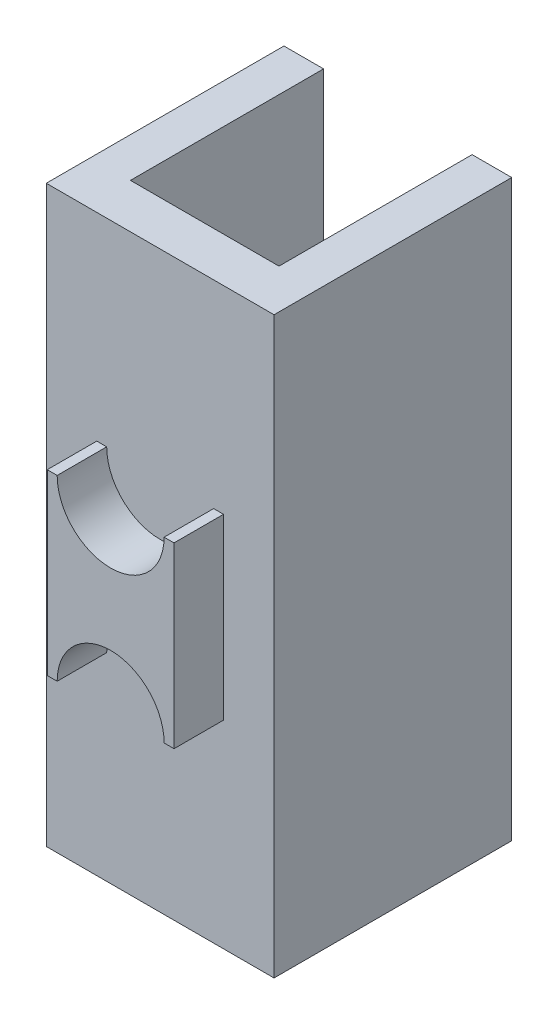
ISO-10303-21;
HEADER;
FILE_DESCRIPTION(('STEP AP214'),'2;1');
FILE_NAME('part.step','',(''),(''),'','','');
FILE_SCHEMA(('AUTOMOTIVE_DESIGN { 1 0 10303 214 1 1 1 1 }'));
ENDSEC;
DATA;
#1=APPLICATION_CONTEXT('core data for automotive mechanical design processes');
#2=APPLICATION_PROTOCOL_DEFINITION('international standard','automotive_design',2000,#1);
#3=PRODUCT_CONTEXT('',#1,'mechanical');
#4=PRODUCT('Part','Part','',(#3));
#5=PRODUCT_RELATED_PRODUCT_CATEGORY('part','',(#4));
#6=PRODUCT_DEFINITION_FORMATION('','',#4);
#7=PRODUCT_DEFINITION_CONTEXT('part definition',#1,'design');
#8=PRODUCT_DEFINITION('design','',#6,#7);
#9=PRODUCT_DEFINITION_SHAPE('','',#8);
#10=(LENGTH_UNIT() NAMED_UNIT(*) SI_UNIT(.MILLI.,.METRE.));
#11=(NAMED_UNIT(*) PLANE_ANGLE_UNIT() SI_UNIT($,.RADIAN.));
#12=(NAMED_UNIT(*) SI_UNIT($,.STERADIAN.) SOLID_ANGLE_UNIT());
#13=UNCERTAINTY_MEASURE_WITH_UNIT(LENGTH_MEASURE(1.E-05),#10,'distance_accuracy_value','');
#14=(GEOMETRIC_REPRESENTATION_CONTEXT(3) GLOBAL_UNCERTAINTY_ASSIGNED_CONTEXT((#13)) GLOBAL_UNIT_ASSIGNED_CONTEXT((#10,
#11,#12)) REPRESENTATION_CONTEXT('',''));
#15=CARTESIAN_POINT('',(0.,0.,0.));
#16=DIRECTION('',(0.,0.,1.));
#17=DIRECTION('',(1.,0.,0.));
#18=AXIS2_PLACEMENT_3D('',#15,#16,#17);
#19=CARTESIAN_POINT('',(-0.64,-0.9,0.5));
#20=DIRECTION('',(0.,0.,1.));
#21=DIRECTION('',(1.,0.,0.));
#22=AXIS2_PLACEMENT_3D('',#19,#20,#21);
#23=PLANE('',#22);
#24=DIRECTION('',(0.,1.,0.));
#25=VECTOR('',#24,1.);
#26=CARTESIAN_POINT('',(0.64,-0.9,0.5));
#27=LINE('',#26,#25);
#28=CARTESIAN_POINT('',(0.64,-0.9,0.5));
#29=VERTEX_POINT('',#28);
#30=CARTESIAN_POINT('',(0.64,0.9,0.5));
#31=VERTEX_POINT('',#30);
#32=EDGE_CURVE('E227',#29,#31,#27,.T.);
#33=ORIENTED_EDGE('',*,*,#32,.T.);
#34=DIRECTION('',(1.,0.,0.));
#35=VECTOR('',#34,1.);
#36=CARTESIAN_POINT('',(0.64,0.9,0.5));
#37=LINE('',#36,#35);
#38=CARTESIAN_POINT('',(0.540000000000001,0.9,0.5));
#39=VERTEX_POINT('',#38);
#40=EDGE_CURVE('E139',#31,#39,#37,.F.);
#41=ORIENTED_EDGE('',*,*,#40,.T.);
#42=CARTESIAN_POINT('',(0.,0.9,0.5));
#43=DIRECTION('',(0.,0.,1.));
#44=DIRECTION('',(1.,0.,0.));
#45=AXIS2_PLACEMENT_3D('',#42,#43,#44);
#46=CIRCLE('',#45,0.54);
#47=CARTESIAN_POINT('',(-0.539999999999999,0.9,0.5));
#48=VERTEX_POINT('',#47);
#49=EDGE_CURVE('E20',#39,#48,#46,.F.);
#50=ORIENTED_EDGE('',*,*,#49,.T.);
#51=DIRECTION('',(1.,0.,0.));
#52=VECTOR('',#51,1.);
#53=CARTESIAN_POINT('',(0.64,0.9,0.5));
#54=LINE('',#53,#52);
#55=CARTESIAN_POINT('',(-0.64,0.9,0.5));
#56=VERTEX_POINT('',#55);
#57=EDGE_CURVE('E144',#48,#56,#54,.F.);
#58=ORIENTED_EDGE('',*,*,#57,.T.);
#59=DIRECTION('',(0.,1.,0.));
#60=VECTOR('',#59,1.);
#61=CARTESIAN_POINT('',(-0.64,0.9,0.5));
#62=LINE('',#61,#60);
#63=CARTESIAN_POINT('',(-0.64,-0.9,0.5));
#64=VERTEX_POINT('',#63);
#65=EDGE_CURVE('E166',#56,#64,#62,.F.);
#66=ORIENTED_EDGE('',*,*,#65,.T.);
#67=DIRECTION('',(-1.,0.,0.));
#68=VECTOR('',#67,1.);
#69=CARTESIAN_POINT('',(-0.64,-0.9,0.5));
#70=LINE('',#69,#68);
#71=CARTESIAN_POINT('',(-0.539999999999999,-0.9,0.5));
#72=VERTEX_POINT('',#71);
#73=EDGE_CURVE('E210',#64,#72,#70,.F.);
#74=ORIENTED_EDGE('',*,*,#73,.T.);
#75=CARTESIAN_POINT('',(0.,-0.9,0.5));
#76=DIRECTION('',(0.,0.,1.));
#77=DIRECTION('',(1.,0.,0.));
#78=AXIS2_PLACEMENT_3D('',#75,#76,#77);
#79=CIRCLE('',#78,0.54);
#80=CARTESIAN_POINT('',(0.540000000000001,-0.9,0.5));
#81=VERTEX_POINT('',#80);
#82=EDGE_CURVE('E250',#72,#81,#79,.F.);
#83=ORIENTED_EDGE('',*,*,#82,.T.);
#84=DIRECTION('',(-1.,0.,0.));
#85=VECTOR('',#84,1.);
#86=CARTESIAN_POINT('',(-0.64,-0.9,0.5));
#87=LINE('',#86,#85);
#88=EDGE_CURVE('E221',#81,#29,#87,.F.);
#89=ORIENTED_EDGE('',*,*,#88,.T.);
#90=EDGE_LOOP('',(#33,#41,#50,#58,#66,#74,#83,#89));
#91=FACE_BOUND('',#90,.T.);
#92=ADVANCED_FACE('F17',(#91),#23,.T.);
#93=CARTESIAN_POINT('',(-1.15,-2.9,-2.4));
#94=DIRECTION('',(0.,0.,1.));
#95=DIRECTION('',(1.,0.,0.));
#96=AXIS2_PLACEMENT_3D('',#93,#94,#95);
#97=PLANE('',#96);
#98=DIRECTION('',(0.,1.,0.));
#99=VECTOR('',#98,1.);
#100=CARTESIAN_POINT('',(-0.75,-6.685057965343,-2.4));
#101=LINE('',#100,#99);
#102=CARTESIAN_POINT('',(-0.75,-2.9,-2.4));
#103=VERTEX_POINT('',#102);
#104=CARTESIAN_POINT('',(-0.75,2.9,-2.4));
#105=VERTEX_POINT('',#104);
#106=EDGE_CURVE('E302',#103,#105,#101,.T.);
#107=ORIENTED_EDGE('',*,*,#106,.F.);
#108=DIRECTION('',(1.,0.,0.));
#109=VECTOR('',#108,1.);
#110=CARTESIAN_POINT('',(-1.15,-2.9,-2.4));
#111=LINE('',#110,#109);
#112=CARTESIAN_POINT('',(-1.15,-2.9,-2.4));
#113=VERTEX_POINT('',#112);
#114=EDGE_CURVE('E197',#113,#103,#111,.T.);
#115=ORIENTED_EDGE('',*,*,#114,.F.);
#116=DIRECTION('',(0.,-1.,0.));
#117=VECTOR('',#116,1.);
#118=CARTESIAN_POINT('',(-1.15,2.9,-2.4));
#119=LINE('',#118,#117);
#120=CARTESIAN_POINT('',(-1.15,2.9,-2.4));
#121=VERTEX_POINT('',#120);
#122=EDGE_CURVE('E245',#121,#113,#119,.T.);
#123=ORIENTED_EDGE('',*,*,#122,.F.);
#124=DIRECTION('',(1.,0.,0.));
#125=VECTOR('',#124,1.);
#126=CARTESIAN_POINT('',(-1.15,2.9,-2.4));
#127=LINE('',#126,#125);
#128=EDGE_CURVE('E185',#105,#121,#127,.F.);
#129=ORIENTED_EDGE('',*,*,#128,.F.);
#130=EDGE_LOOP('',(#107,#115,#123,#129));
#131=FACE_BOUND('',#130,.T.);
#132=ADVANCED_FACE('F512',(#131),#97,.F.);
#133=CARTESIAN_POINT('',(6.880406964708,0.,-0.45));
#134=DIRECTION('',(1.,0.,0.));
#135=DIRECTION('',(0.,0.,-1.));
#136=AXIS2_PLACEMENT_3D('',#133,#134,#135);
#137=CYLINDRICAL_SURFACE('',#136,0.45);
#138=CARTESIAN_POINT('',(-0.75,0.,-0.45));
#139=DIRECTION('',(1.,0.,0.));
#140=DIRECTION('',(0.,0.,-1.));
#141=AXIS2_PLACEMENT_3D('',#138,#139,#140);
#142=CIRCLE('',#141,0.45);
#143=CARTESIAN_POINT('',(-0.75,0.45,-0.45));
#144=VERTEX_POINT('',#143);
#145=CARTESIAN_POINT('',(-0.75,-0.45,-0.45));
#146=VERTEX_POINT('',#145);
#147=EDGE_CURVE('E246',#144,#146,#142,.F.);
#148=ORIENTED_EDGE('',*,*,#147,.F.);
#149=DIRECTION('',(-1.,0.,0.));
#150=VECTOR('',#149,1.);
#151=CARTESIAN_POINT('',(0.75,0.45,-0.45));
#152=LINE('',#151,#150);
#153=CARTESIAN_POINT('',(0.75,0.45,-0.45));
#154=VERTEX_POINT('',#153);
#155=EDGE_CURVE('E183',#154,#144,#152,.T.);
#156=ORIENTED_EDGE('',*,*,#155,.F.);
#157=CARTESIAN_POINT('',(0.75,0.,-0.45));
#158=DIRECTION('',(1.,0.,0.));
#159=DIRECTION('',(0.,0.,-1.));
#160=AXIS2_PLACEMENT_3D('',#157,#158,#159);
#161=CIRCLE('',#160,0.45);
#162=CARTESIAN_POINT('',(0.75,-0.45,-0.45));
#163=VERTEX_POINT('',#162);
#164=EDGE_CURVE('E241',#163,#154,#161,.T.);
#165=ORIENTED_EDGE('',*,*,#164,.F.);
#166=DIRECTION('',(-1.,0.,0.));
#167=VECTOR('',#166,1.);
#168=CARTESIAN_POINT('',(0.75,-0.45,-0.45));
#169=LINE('',#168,#167);
#170=EDGE_CURVE('E170',#146,#163,#169,.F.);
#171=ORIENTED_EDGE('',*,*,#170,.F.);
#172=EDGE_LOOP('',(#148,#156,#165,#171));
#173=FACE_BOUND('',#172,.T.);
#174=ADVANCED_FACE('F503',(#173),#137,.T.);
#175=CARTESIAN_POINT('',(0.75,-6.685057965343,-0.45));
#176=DIRECTION('',(0.,0.,-1.));
#177=DIRECTION('',(-1.,0.,0.));
#178=AXIS2_PLACEMENT_3D('',#175,#176,#177);
#179=PLANE('',#178);
#180=DIRECTION('',(-1.,0.,0.));
#181=VECTOR('',#180,1.);
#182=CARTESIAN_POINT('',(0.75,2.9,-0.45));
#183=LINE('',#182,#181);
#184=CARTESIAN_POINT('',(-0.75,2.9,-0.45));
#185=VERTEX_POINT('',#184);
#186=CARTESIAN_POINT('',(0.75,2.9,-0.45));
#187=VERTEX_POINT('',#186);
#188=EDGE_CURVE('E173',#185,#187,#183,.F.);
#189=ORIENTED_EDGE('',*,*,#188,.T.);
#190=DIRECTION('',(0.,1.,0.));
#191=VECTOR('',#190,1.);
#192=CARTESIAN_POINT('',(0.75,-6.685057965343,-0.45));
#193=LINE('',#192,#191);
#194=EDGE_CURVE('E244',#154,#187,#193,.T.);
#195=ORIENTED_EDGE('',*,*,#194,.F.);
#196=ORIENTED_EDGE('',*,*,#155,.T.);
#197=DIRECTION('',(0.,1.,0.));
#198=VECTOR('',#197,1.);
#199=CARTESIAN_POINT('',(-0.75,-6.685057965343,-0.45));
#200=LINE('',#199,#198);
#201=EDGE_CURVE('E249',#185,#144,#200,.F.);
#202=ORIENTED_EDGE('',*,*,#201,.F.);
#203=EDGE_LOOP('',(#189,#195,#196,#202));
#204=FACE_BOUND('',#203,.T.);
#205=ADVANCED_FACE('F494',(#204),#179,.T.);
#206=CARTESIAN_POINT('',(0.75,-6.685057965343,-0.45));
#207=DIRECTION('',(0.,0.,-1.));
#208=DIRECTION('',(-1.,0.,0.));
#209=AXIS2_PLACEMENT_3D('',#206,#207,#208);
#210=PLANE('',#209);
#211=DIRECTION('',(0.,1.,0.));
#212=VECTOR('',#211,1.);
#213=CARTESIAN_POINT('',(0.75,-6.685057965343,-0.45));
#214=LINE('',#213,#212);
#215=CARTESIAN_POINT('',(0.75,-2.9,-0.45));
#216=VERTEX_POINT('',#215);
#217=EDGE_CURVE('E207',#216,#163,#214,.T.);
#218=ORIENTED_EDGE('',*,*,#217,.F.);
#219=DIRECTION('',(-1.,0.,0.));
#220=VECTOR('',#219,1.);
#221=CARTESIAN_POINT('',(0.75,-2.9,-0.45));
#222=LINE('',#221,#220);
#223=CARTESIAN_POINT('',(-0.75,-2.9,-0.45));
#224=VERTEX_POINT('',#223);
#225=EDGE_CURVE('E152',#216,#224,#222,.T.);
#226=ORIENTED_EDGE('',*,*,#225,.T.);
#227=DIRECTION('',(0.,1.,0.));
#228=VECTOR('',#227,1.);
#229=CARTESIAN_POINT('',(-0.75,-6.685057965343,-0.45));
#230=LINE('',#229,#228);
#231=EDGE_CURVE('E248',#146,#224,#230,.F.);
#232=ORIENTED_EDGE('',*,*,#231,.F.);
#233=ORIENTED_EDGE('',*,*,#170,.T.);
#234=EDGE_LOOP('',(#218,#226,#232,#233));
#235=FACE_BOUND('',#234,.T.);
#236=ADVANCED_FACE('F486',(#235),#210,.T.);
#237=CARTESIAN_POINT('',(0.64,0.9,0.5));
#238=DIRECTION('',(0.,-1.,0.));
#239=DIRECTION('',(1.,0.,0.));
#240=AXIS2_PLACEMENT_3D('',#237,#238,#239);
#241=PLANE('',#240);
#242=DIRECTION('',(0.,0.,1.));
#243=VECTOR('',#242,1.);
#244=CARTESIAN_POINT('',(-0.539999999999999,0.9,6.880406964708));
#245=LINE('',#244,#243);
#246=CARTESIAN_POINT('',(-0.539999999999999,0.9,0.));
#247=VERTEX_POINT('',#246);
#248=EDGE_CURVE('E147',#48,#247,#245,.F.);
#249=ORIENTED_EDGE('',*,*,#248,.T.);
#250=DIRECTION('',(1.,0.,0.));
#251=VECTOR('',#250,1.);
#252=CARTESIAN_POINT('',(-1.15,0.9,0.));
#253=LINE('',#252,#251);
#254=CARTESIAN_POINT('',(-0.64,0.9,0.));
#255=VERTEX_POINT('',#254);
#256=EDGE_CURVE('E192',#255,#247,#253,.T.);
#257=ORIENTED_EDGE('',*,*,#256,.F.);
#258=DIRECTION('',(0.,0.,-1.));
#259=VECTOR('',#258,1.);
#260=CARTESIAN_POINT('',(-0.64,0.9,0.5));
#261=LINE('',#260,#259);
#262=EDGE_CURVE('E150',#255,#56,#261,.F.);
#263=ORIENTED_EDGE('',*,*,#262,.T.);
#264=ORIENTED_EDGE('',*,*,#57,.F.);
#265=EDGE_LOOP('',(#249,#257,#263,#264));
#266=FACE_BOUND('',#265,.T.);
#267=ADVANCED_FACE('F145',(#266),#241,.F.);
#268=CARTESIAN_POINT('',(0.,0.9,6.880406964708));
#269=DIRECTION('',(0.,0.,1.));
#270=DIRECTION('',(1.,0.,0.));
#271=AXIS2_PLACEMENT_3D('',#268,#269,#270);
#272=CYLINDRICAL_SURFACE('',#271,0.54);
#273=DIRECTION('',(0.,0.,1.));
#274=VECTOR('',#273,1.);
#275=CARTESIAN_POINT('',(0.54,0.9,0.5));
#276=LINE('',#275,#274);
#277=CARTESIAN_POINT('',(0.540000000000001,0.9,0.));
#278=VERTEX_POINT('',#277);
#279=EDGE_CURVE('E163',#39,#278,#276,.F.);
#280=ORIENTED_EDGE('',*,*,#279,.T.);
#281=CARTESIAN_POINT('',(0.,0.9,0.));
#282=DIRECTION('',(0.,0.,1.));
#283=DIRECTION('',(1.,0.,0.));
#284=AXIS2_PLACEMENT_3D('',#281,#282,#283);
#285=CIRCLE('',#284,0.54);
#286=EDGE_CURVE('E158',#247,#278,#285,.T.);
#287=ORIENTED_EDGE('',*,*,#286,.F.);
#288=ORIENTED_EDGE('',*,*,#248,.F.);
#289=ORIENTED_EDGE('',*,*,#49,.F.);
#290=EDGE_LOOP('',(#280,#287,#288,#289));
#291=FACE_BOUND('',#290,.T.);
#292=ADVANCED_FACE('F156',(#291),#272,.F.);
#293=CARTESIAN_POINT('',(0.64,0.9,0.5));
#294=DIRECTION('',(0.,-1.,0.));
#295=DIRECTION('',(1.,0.,0.));
#296=AXIS2_PLACEMENT_3D('',#293,#294,#295);
#297=PLANE('',#296);
#298=ORIENTED_EDGE('',*,*,#279,.F.);
#299=ORIENTED_EDGE('',*,*,#40,.F.);
#300=DIRECTION('',(0.,0.,1.));
#301=VECTOR('',#300,1.);
#302=CARTESIAN_POINT('',(0.64,0.9,0.5));
#303=LINE('',#302,#301);
#304=CARTESIAN_POINT('',(0.64,0.9,0.));
#305=VERTEX_POINT('',#304);
#306=EDGE_CURVE('E224',#31,#305,#303,.F.);
#307=ORIENTED_EDGE('',*,*,#306,.T.);
#308=DIRECTION('',(1.,0.,0.));
#309=VECTOR('',#308,1.);
#310=CARTESIAN_POINT('',(-1.15,0.9,0.));
#311=LINE('',#310,#309);
#312=EDGE_CURVE('E240',#278,#305,#311,.T.);
#313=ORIENTED_EDGE('',*,*,#312,.F.);
#314=EDGE_LOOP('',(#298,#299,#307,#313));
#315=FACE_BOUND('',#314,.T.);
#316=ADVANCED_FACE('F273',(#315),#297,.F.);
#317=CARTESIAN_POINT('',(0.64,-0.9,0.5));
#318=DIRECTION('',(-1.,0.,0.));
#319=DIRECTION('',(0.,0.,1.));
#320=AXIS2_PLACEMENT_3D('',#317,#318,#319);
#321=PLANE('',#320);
#322=ORIENTED_EDGE('',*,*,#306,.F.);
#323=ORIENTED_EDGE('',*,*,#32,.F.);
#324=DIRECTION('',(0.,0.,1.));
#325=VECTOR('',#324,1.);
#326=CARTESIAN_POINT('',(0.64,-0.9,0.5));
#327=LINE('',#326,#325);
#328=CARTESIAN_POINT('',(0.64,-0.9,0.));
#329=VERTEX_POINT('',#328);
#330=EDGE_CURVE('E223',#29,#329,#327,.F.);
#331=ORIENTED_EDGE('',*,*,#330,.T.);
#332=DIRECTION('',(0.,1.,0.));
#333=VECTOR('',#332,1.);
#334=CARTESIAN_POINT('',(0.64,-2.9,0.));
#335=LINE('',#334,#333);
#336=EDGE_CURVE('E264',#305,#329,#335,.F.);
#337=ORIENTED_EDGE('',*,*,#336,.F.);
#338=EDGE_LOOP('',(#322,#323,#331,#337));
#339=FACE_BOUND('',#338,.T.);
#340=ADVANCED_FACE('F275',(#339),#321,.F.);
#341=CARTESIAN_POINT('',(-0.64,-0.9,0.5));
#342=DIRECTION('',(0.,1.,0.));
#343=DIRECTION('',(-1.,0.,0.));
#344=AXIS2_PLACEMENT_3D('',#341,#342,#343);
#345=PLANE('',#344);
#346=DIRECTION('',(1.,0.,0.));
#347=VECTOR('',#346,1.);
#348=CARTESIAN_POINT('',(-1.15,-0.9,0.));
#349=LINE('',#348,#347);
#350=CARTESIAN_POINT('',(0.540000000000001,-0.9,0.));
#351=VERTEX_POINT('',#350);
#352=EDGE_CURVE('E238',#329,#351,#349,.F.);
#353=ORIENTED_EDGE('',*,*,#352,.F.);
#354=ORIENTED_EDGE('',*,*,#330,.F.);
#355=ORIENTED_EDGE('',*,*,#88,.F.);
#356=DIRECTION('',(0.,0.,1.));
#357=VECTOR('',#356,1.);
#358=CARTESIAN_POINT('',(0.540000000000001,-0.9,6.880406964708));
#359=LINE('',#358,#357);
#360=EDGE_CURVE('E212',#81,#351,#359,.F.);
#361=ORIENTED_EDGE('',*,*,#360,.T.);
#362=EDGE_LOOP('',(#353,#354,#355,#361));
#363=FACE_BOUND('',#362,.T.);
#364=ADVANCED_FACE('F337',(#363),#345,.F.);
#365=CARTESIAN_POINT('',(0.,-0.9,6.880406964708));
#366=DIRECTION('',(0.,0.,1.));
#367=DIRECTION('',(1.,0.,0.));
#368=AXIS2_PLACEMENT_3D('',#365,#366,#367);
#369=CYLINDRICAL_SURFACE('',#368,0.54);
#370=ORIENTED_EDGE('',*,*,#82,.F.);
#371=DIRECTION('',(0.,0.,1.));
#372=VECTOR('',#371,1.);
#373=CARTESIAN_POINT('',(-0.54,-0.9,0.5));
#374=LINE('',#373,#372);
#375=CARTESIAN_POINT('',(-0.539999999999999,-0.9,0.));
#376=VERTEX_POINT('',#375);
#377=EDGE_CURVE('E167',#72,#376,#374,.F.);
#378=ORIENTED_EDGE('',*,*,#377,.T.);
#379=CARTESIAN_POINT('',(0.,-0.9,0.));
#380=DIRECTION('',(0.,0.,1.));
#381=DIRECTION('',(1.,0.,0.));
#382=AXIS2_PLACEMENT_3D('',#379,#380,#381);
#383=CIRCLE('',#382,0.54);
#384=EDGE_CURVE('E234',#351,#376,#383,.T.);
#385=ORIENTED_EDGE('',*,*,#384,.F.);
#386=ORIENTED_EDGE('',*,*,#360,.F.);
#387=EDGE_LOOP('',(#370,#378,#385,#386));
#388=FACE_BOUND('',#387,.T.);
#389=ADVANCED_FACE('F340',(#388),#369,.F.);
#390=CARTESIAN_POINT('',(-0.64,-0.9,0.5));
#391=DIRECTION('',(0.,1.,0.));
#392=DIRECTION('',(-1.,0.,0.));
#393=AXIS2_PLACEMENT_3D('',#390,#391,#392);
#394=PLANE('',#393);
#395=ORIENTED_EDGE('',*,*,#73,.F.);
#396=DIRECTION('',(0.,0.,-1.));
#397=VECTOR('',#396,1.);
#398=CARTESIAN_POINT('',(-0.64,-0.9,0.5));
#399=LINE('',#398,#397);
#400=CARTESIAN_POINT('',(-0.64,-0.9,0.));
#401=VERTEX_POINT('',#400);
#402=EDGE_CURVE('E216',#64,#401,#399,.T.);
#403=ORIENTED_EDGE('',*,*,#402,.T.);
#404=DIRECTION('',(1.,0.,0.));
#405=VECTOR('',#404,1.);
#406=CARTESIAN_POINT('',(-1.15,-0.9,0.));
#407=LINE('',#406,#405);
#408=EDGE_CURVE('E237',#376,#401,#407,.F.);
#409=ORIENTED_EDGE('',*,*,#408,.F.);
#410=ORIENTED_EDGE('',*,*,#377,.F.);
#411=EDGE_LOOP('',(#395,#403,#409,#410));
#412=FACE_BOUND('',#411,.T.);
#413=ADVANCED_FACE('F326',(#412),#394,.F.);
#414=CARTESIAN_POINT('',(-0.64,0.9,0.5));
#415=DIRECTION('',(1.,0.,0.));
#416=DIRECTION('',(0.,0.,-1.));
#417=AXIS2_PLACEMENT_3D('',#414,#415,#416);
#418=PLANE('',#417);
#419=ORIENTED_EDGE('',*,*,#402,.F.);
#420=ORIENTED_EDGE('',*,*,#65,.F.);
#421=ORIENTED_EDGE('',*,*,#262,.F.);
#422=DIRECTION('',(0.,1.,0.));
#423=VECTOR('',#422,1.);
#424=CARTESIAN_POINT('',(-0.64,-2.9,0.));
#425=LINE('',#424,#423);
#426=EDGE_CURVE('E314',#401,#255,#425,.T.);
#427=ORIENTED_EDGE('',*,*,#426,.F.);
#428=EDGE_LOOP('',(#419,#420,#421,#427));
#429=FACE_BOUND('',#428,.T.);
#430=ADVANCED_FACE('F329',(#429),#418,.F.);
#431=CARTESIAN_POINT('',(-0.75,-6.685057965343,-0.45));
#432=DIRECTION('',(1.,0.,0.));
#433=DIRECTION('',(0.,0.,-1.));
#434=AXIS2_PLACEMENT_3D('',#431,#432,#433);
#435=PLANE('',#434);
#436=ORIENTED_EDGE('',*,*,#106,.T.);
#437=DIRECTION('',(0.,0.,1.));
#438=VECTOR('',#437,1.);
#439=CARTESIAN_POINT('',(-0.75,2.9,-2.4));
#440=LINE('',#439,#438);
#441=EDGE_CURVE('E204',#185,#105,#440,.F.);
#442=ORIENTED_EDGE('',*,*,#441,.F.);
#443=ORIENTED_EDGE('',*,*,#201,.T.);
#444=ORIENTED_EDGE('',*,*,#147,.T.);
#445=ORIENTED_EDGE('',*,*,#231,.T.);
#446=DIRECTION('',(0.,0.,-1.));
#447=VECTOR('',#446,1.);
#448=CARTESIAN_POINT('',(-0.75,-2.9,-2.4));
#449=LINE('',#448,#447);
#450=EDGE_CURVE('E180',#103,#224,#449,.F.);
#451=ORIENTED_EDGE('',*,*,#450,.F.);
#452=EDGE_LOOP('',(#436,#442,#443,#444,#445,#451));
#453=FACE_BOUND('',#452,.T.);
#454=ADVANCED_FACE('F379',(#453),#435,.T.);
#455=CARTESIAN_POINT('',(-1.15,2.9,-2.4));
#456=DIRECTION('',(-1.,0.,0.));
#457=DIRECTION('',(0.,-1.,0.));
#458=AXIS2_PLACEMENT_3D('',#455,#456,#457);
#459=PLANE('',#458);
#460=DIRECTION('',(0.,0.,1.));
#461=VECTOR('',#460,1.);
#462=CARTESIAN_POINT('',(-1.15,2.9,-2.4));
#463=LINE('',#462,#461);
#464=CARTESIAN_POINT('',(-1.15,2.9,0.));
#465=VERTEX_POINT('',#464);
#466=EDGE_CURVE('E193',#121,#465,#463,.T.);
#467=ORIENTED_EDGE('',*,*,#466,.F.);
#468=ORIENTED_EDGE('',*,*,#122,.T.);
#469=DIRECTION('',(0.,0.,-1.));
#470=VECTOR('',#469,1.);
#471=CARTESIAN_POINT('',(-1.15,-2.9,-2.4));
#472=LINE('',#471,#470);
#473=CARTESIAN_POINT('',(-1.15,-2.9,0.));
#474=VERTEX_POINT('',#473);
#475=EDGE_CURVE('E547',#474,#113,#472,.T.);
#476=ORIENTED_EDGE('',*,*,#475,.F.);
#477=DIRECTION('',(0.,1.,0.));
#478=VECTOR('',#477,1.);
#479=CARTESIAN_POINT('',(-1.15,-2.9,0.));
#480=LINE('',#479,#478);
#481=EDGE_CURVE('E317',#465,#474,#480,.F.);
#482=ORIENTED_EDGE('',*,*,#481,.F.);
#483=EDGE_LOOP('',(#467,#468,#476,#482));
#484=FACE_BOUND('',#483,.T.);
#485=ADVANCED_FACE('F375',(#484),#459,.T.);
#486=CARTESIAN_POINT('',(0.75,-6.685057965343,-2.4));
#487=DIRECTION('',(-1.,0.,0.));
#488=DIRECTION('',(0.,0.,1.));
#489=AXIS2_PLACEMENT_3D('',#486,#487,#488);
#490=PLANE('',#489);
#491=DIRECTION('',(0.,0.,-1.));
#492=VECTOR('',#491,1.);
#493=CARTESIAN_POINT('',(0.75,-2.9,-2.4));
#494=LINE('',#493,#492);
#495=CARTESIAN_POINT('',(0.75,-2.9,-2.4));
#496=VERTEX_POINT('',#495);
#497=EDGE_CURVE('E177',#216,#496,#494,.T.);
#498=ORIENTED_EDGE('',*,*,#497,.F.);
#499=ORIENTED_EDGE('',*,*,#217,.T.);
#500=ORIENTED_EDGE('',*,*,#164,.T.);
#501=ORIENTED_EDGE('',*,*,#194,.T.);
#502=DIRECTION('',(0.,0.,1.));
#503=VECTOR('',#502,1.);
#504=CARTESIAN_POINT('',(0.75,2.9,-2.4));
#505=LINE('',#504,#503);
#506=CARTESIAN_POINT('',(0.75,2.9,-2.4));
#507=VERTEX_POINT('',#506);
#508=EDGE_CURVE('E189',#507,#187,#505,.T.);
#509=ORIENTED_EDGE('',*,*,#508,.F.);
#510=DIRECTION('',(0.,1.,0.));
#511=VECTOR('',#510,1.);
#512=CARTESIAN_POINT('',(0.75,-2.9,-2.4));
#513=LINE('',#512,#511);
#514=EDGE_CURVE('E562',#507,#496,#513,.F.);
#515=ORIENTED_EDGE('',*,*,#514,.T.);
#516=EDGE_LOOP('',(#498,#499,#500,#501,#509,#515));
#517=FACE_BOUND('',#516,.T.);
#518=ADVANCED_FACE('F371',(#517),#490,.T.);
#519=CARTESIAN_POINT('',(1.15,2.9,-2.4));
#520=DIRECTION('',(0.,1.,0.));
#521=DIRECTION('',(0.,0.,1.));
#522=AXIS2_PLACEMENT_3D('',#519,#520,#521);
#523=PLANE('',#522);
#524=ORIENTED_EDGE('',*,*,#508,.T.);
#525=ORIENTED_EDGE('',*,*,#188,.F.);
#526=ORIENTED_EDGE('',*,*,#441,.T.);
#527=ORIENTED_EDGE('',*,*,#128,.T.);
#528=ORIENTED_EDGE('',*,*,#466,.T.);
#529=DIRECTION('',(1.,0.,0.));
#530=VECTOR('',#529,1.);
#531=CARTESIAN_POINT('',(-1.15,2.9,0.));
#532=LINE('',#531,#530);
#533=CARTESIAN_POINT('',(1.15,2.9,0.));
#534=VERTEX_POINT('',#533);
#535=EDGE_CURVE('E201',#534,#465,#532,.F.);
#536=ORIENTED_EDGE('',*,*,#535,.F.);
#537=DIRECTION('',(0.,0.,1.));
#538=VECTOR('',#537,1.);
#539=CARTESIAN_POINT('',(1.15,2.9,-2.4));
#540=LINE('',#539,#538);
#541=CARTESIAN_POINT('',(1.15,2.9,-2.4));
#542=VERTEX_POINT('',#541);
#543=EDGE_CURVE('E565',#542,#534,#540,.T.);
#544=ORIENTED_EDGE('',*,*,#543,.F.);
#545=DIRECTION('',(1.,0.,0.));
#546=VECTOR('',#545,1.);
#547=CARTESIAN_POINT('',(-1.15,2.9,-2.4));
#548=LINE('',#547,#546);
#549=EDGE_CURVE('E549',#542,#507,#548,.F.);
#550=ORIENTED_EDGE('',*,*,#549,.T.);
#551=EDGE_LOOP('',(#524,#525,#526,#527,#528,#536,#544,#550));
#552=FACE_BOUND('',#551,.T.);
#553=ADVANCED_FACE('F367',(#552),#523,.T.);
#554=CARTESIAN_POINT('',(-1.15,-2.9,0.));
#555=DIRECTION('',(0.,0.,1.));
#556=DIRECTION('',(1.,0.,0.));
#557=AXIS2_PLACEMENT_3D('',#554,#555,#556);
#558=PLANE('',#557);
#559=DIRECTION('',(0.,1.,0.));
#560=VECTOR('',#559,1.);
#561=CARTESIAN_POINT('',(1.15,-2.9,0.));
#562=LINE('',#561,#560);
#563=CARTESIAN_POINT('',(1.15,-2.9,0.));
#564=VERTEX_POINT('',#563);
#565=EDGE_CURVE('E569',#534,#564,#562,.F.);
#566=ORIENTED_EDGE('',*,*,#565,.F.);
#567=ORIENTED_EDGE('',*,*,#535,.T.);
#568=ORIENTED_EDGE('',*,*,#481,.T.);
#569=DIRECTION('',(1.,0.,0.));
#570=VECTOR('',#569,1.);
#571=CARTESIAN_POINT('',(-1.15,-2.9,0.));
#572=LINE('',#571,#570);
#573=EDGE_CURVE('E179',#564,#474,#572,.F.);
#574=ORIENTED_EDGE('',*,*,#573,.F.);
#575=EDGE_LOOP('',(#566,#567,#568,#574));
#576=FACE_BOUND('',#575,.T.);
#577=ORIENTED_EDGE('',*,*,#408,.T.);
#578=ORIENTED_EDGE('',*,*,#426,.T.);
#579=ORIENTED_EDGE('',*,*,#256,.T.);
#580=ORIENTED_EDGE('',*,*,#286,.T.);
#581=ORIENTED_EDGE('',*,*,#312,.T.);
#582=ORIENTED_EDGE('',*,*,#336,.T.);
#583=ORIENTED_EDGE('',*,*,#352,.T.);
#584=ORIENTED_EDGE('',*,*,#384,.T.);
#585=EDGE_LOOP('',(#577,#578,#579,#580,#581,#582,#583,#584));
#586=FACE_BOUND('',#585,.T.);
#587=ADVANCED_FACE('F279',(#576,#586),#558,.T.);
#588=CARTESIAN_POINT('',(-1.15,-2.9,-2.4));
#589=DIRECTION('',(0.,-1.,0.));
#590=DIRECTION('',(0.,0.,-1.));
#591=AXIS2_PLACEMENT_3D('',#588,#589,#590);
#592=PLANE('',#591);
#593=ORIENTED_EDGE('',*,*,#573,.T.);
#594=ORIENTED_EDGE('',*,*,#475,.T.);
#595=ORIENTED_EDGE('',*,*,#114,.T.);
#596=ORIENTED_EDGE('',*,*,#450,.T.);
#597=ORIENTED_EDGE('',*,*,#225,.F.);
#598=ORIENTED_EDGE('',*,*,#497,.T.);
#599=DIRECTION('',(1.,0.,0.));
#600=VECTOR('',#599,1.);
#601=CARTESIAN_POINT('',(-1.15,-2.9,-2.4));
#602=LINE('',#601,#600);
#603=CARTESIAN_POINT('',(1.15,-2.9,-2.4));
#604=VERTEX_POINT('',#603);
#605=EDGE_CURVE('E35',#496,#604,#602,.T.);
#606=ORIENTED_EDGE('',*,*,#605,.T.);
#607=DIRECTION('',(0.,0.,1.));
#608=VECTOR('',#607,1.);
#609=CARTESIAN_POINT('',(1.15,-2.9,-2.4));
#610=LINE('',#609,#608);
#611=EDGE_CURVE('E26',#564,#604,#610,.F.);
#612=ORIENTED_EDGE('',*,*,#611,.F.);
#613=EDGE_LOOP('',(#593,#594,#595,#596,#597,#598,#606,#612));
#614=FACE_BOUND('',#613,.T.);
#615=ADVANCED_FACE('F358',(#614),#592,.T.);
#616=CARTESIAN_POINT('',(-1.15,-2.9,-2.4));
#617=DIRECTION('',(0.,0.,1.));
#618=DIRECTION('',(1.,0.,0.));
#619=AXIS2_PLACEMENT_3D('',#616,#617,#618);
#620=PLANE('',#619);
#621=ORIENTED_EDGE('',*,*,#549,.F.);
#622=DIRECTION('',(0.,1.,0.));
#623=VECTOR('',#622,1.);
#624=CARTESIAN_POINT('',(1.15,-2.9,-2.4));
#625=LINE('',#624,#623);
#626=EDGE_CURVE('E11',#604,#542,#625,.T.);
#627=ORIENTED_EDGE('',*,*,#626,.F.);
#628=ORIENTED_EDGE('',*,*,#605,.F.);
#629=ORIENTED_EDGE('',*,*,#514,.F.);
#630=EDGE_LOOP('',(#621,#627,#628,#629));
#631=FACE_BOUND('',#630,.T.);
#632=ADVANCED_FACE('F352',(#631),#620,.F.);
#633=CARTESIAN_POINT('',(1.15,-2.9,-2.4));
#634=DIRECTION('',(1.,0.,0.));
#635=DIRECTION('',(0.,1.,0.));
#636=AXIS2_PLACEMENT_3D('',#633,#634,#635);
#637=PLANE('',#636);
#638=ORIENTED_EDGE('',*,*,#611,.T.);
#639=ORIENTED_EDGE('',*,*,#626,.T.);
#640=ORIENTED_EDGE('',*,*,#543,.T.);
#641=ORIENTED_EDGE('',*,*,#565,.T.);
#642=EDGE_LOOP('',(#638,#639,#640,#641));
#643=FACE_BOUND('',#642,.T.);
#644=ADVANCED_FACE('F350',(#643),#637,.T.);
#645=CLOSED_SHELL('',(#92,#132,#174,#205,#236,#267,#292,#316,#340,#364,#389,#413,#430,#454,#485,
#518,#553,#587,#615,#632,#644));
#646=MANIFOLD_SOLID_BREP('B1',#645);
#647=ADVANCED_BREP_SHAPE_REPRESENTATION('',(#18,#646),#14);
#648=SHAPE_DEFINITION_REPRESENTATION(#9,#647);
ENDSEC;
END-ISO-10303-21;
